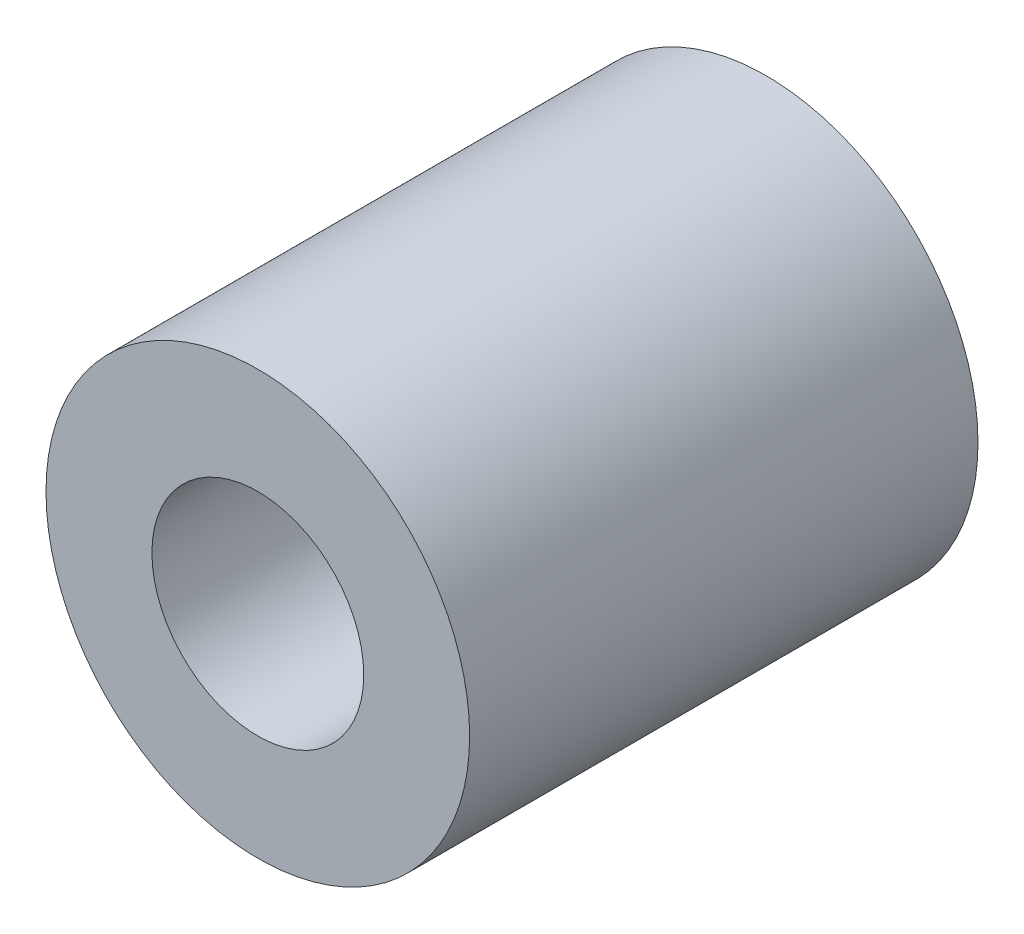
ISO-10303-21;
HEADER;
FILE_DESCRIPTION(('STEP AP214'),'2;1');
FILE_NAME('part.step','',(''),(''),'','','');
FILE_SCHEMA(('AUTOMOTIVE_DESIGN { 1 0 10303 214 1 1 1 1 }'));
ENDSEC;
DATA;
#1=APPLICATION_CONTEXT('core data for automotive mechanical design processes');
#2=APPLICATION_PROTOCOL_DEFINITION('international standard','automotive_design',2000,#1);
#3=PRODUCT_CONTEXT('',#1,'mechanical');
#4=PRODUCT('Part','Part','',(#3));
#5=PRODUCT_RELATED_PRODUCT_CATEGORY('part','',(#4));
#6=PRODUCT_DEFINITION_FORMATION('','',#4);
#7=PRODUCT_DEFINITION_CONTEXT('part definition',#1,'design');
#8=PRODUCT_DEFINITION('design','',#6,#7);
#9=PRODUCT_DEFINITION_SHAPE('','',#8);
#10=(LENGTH_UNIT() NAMED_UNIT(*) SI_UNIT(.MILLI.,.METRE.));
#11=(NAMED_UNIT(*) PLANE_ANGLE_UNIT() SI_UNIT($,.RADIAN.));
#12=(NAMED_UNIT(*) SI_UNIT($,.STERADIAN.) SOLID_ANGLE_UNIT());
#13=UNCERTAINTY_MEASURE_WITH_UNIT(LENGTH_MEASURE(1.E-05),#10,'distance_accuracy_value','');
#14=(GEOMETRIC_REPRESENTATION_CONTEXT(3) GLOBAL_UNCERTAINTY_ASSIGNED_CONTEXT((#13)) GLOBAL_UNIT_ASSIGNED_CONTEXT((#10,
#11,#12)) REPRESENTATION_CONTEXT('',''));
#15=CARTESIAN_POINT('',(0.,0.,0.));
#16=DIRECTION('',(0.,0.,1.));
#17=DIRECTION('',(1.,0.,0.));
#18=AXIS2_PLACEMENT_3D('',#15,#16,#17);
#19=CARTESIAN_POINT('',(0.,0.,12.));
#20=DIRECTION('',(0.,0.,1.));
#21=DIRECTION('',(1.,0.,0.));
#22=AXIS2_PLACEMENT_3D('',#19,#20,#21);
#23=PLANE('',#22);
#24=CARTESIAN_POINT('',(0.,0.,12.));
#25=DIRECTION('',(0.,0.,1.));
#26=DIRECTION('',(1.,0.,0.));
#27=AXIS2_PLACEMENT_3D('',#24,#25,#26);
#28=CIRCLE('',#27,5.);
#29=CARTESIAN_POINT('',(5.,0.,12.));
#30=VERTEX_POINT('',#29);
#31=EDGE_CURVE('E10',#30,#30,#28,.T.);
#32=ORIENTED_EDGE('',*,*,#31,.T.);
#33=EDGE_LOOP('',(#32));
#34=FACE_BOUND('',#33,.T.);
#35=CARTESIAN_POINT('',(0.,0.,12.));
#36=DIRECTION('',(0.,0.,1.));
#37=DIRECTION('',(1.,0.,0.));
#38=AXIS2_PLACEMENT_3D('',#35,#36,#37);
#39=CIRCLE('',#38,2.5);
#40=CARTESIAN_POINT('',(2.5,0.,12.));
#41=VERTEX_POINT('',#40);
#42=EDGE_CURVE('E42',#41,#41,#39,.T.);
#43=ORIENTED_EDGE('',*,*,#42,.F.);
#44=EDGE_LOOP('',(#43));
#45=FACE_BOUND('',#44,.T.);
#46=ADVANCED_FACE('F31',(#34,#45),#23,.T.);
#47=CARTESIAN_POINT('',(0.,0.,0.));
#48=DIRECTION('',(0.,0.,1.));
#49=DIRECTION('',(1.,0.,0.));
#50=AXIS2_PLACEMENT_3D('',#47,#48,#49);
#51=PLANE('',#50);
#52=CARTESIAN_POINT('',(0.,0.,0.));
#53=DIRECTION('',(0.,0.,1.));
#54=DIRECTION('',(1.,0.,0.));
#55=AXIS2_PLACEMENT_3D('',#52,#53,#54);
#56=CIRCLE('',#55,5.);
#57=CARTESIAN_POINT('',(5.,0.,0.));
#58=VERTEX_POINT('',#57);
#59=EDGE_CURVE('E35',#58,#58,#56,.T.);
#60=ORIENTED_EDGE('',*,*,#59,.F.);
#61=EDGE_LOOP('',(#60));
#62=FACE_BOUND('',#61,.T.);
#63=CARTESIAN_POINT('',(0.,0.,0.));
#64=DIRECTION('',(0.,0.,1.));
#65=DIRECTION('',(1.,0.,0.));
#66=AXIS2_PLACEMENT_3D('',#63,#64,#65);
#67=CIRCLE('',#66,2.5);
#68=CARTESIAN_POINT('',(2.5,0.,0.));
#69=VERTEX_POINT('',#68);
#70=EDGE_CURVE('E44',#69,#69,#67,.T.);
#71=ORIENTED_EDGE('',*,*,#70,.T.);
#72=EDGE_LOOP('',(#71));
#73=FACE_BOUND('',#72,.T.);
#74=ADVANCED_FACE('F54',(#62,#73),#51,.F.);
#75=CARTESIAN_POINT('',(0.,0.,12.));
#76=DIRECTION('',(0.,0.,-1.));
#77=DIRECTION('',(-1.,0.,0.));
#78=AXIS2_PLACEMENT_3D('',#75,#76,#77);
#79=CYLINDRICAL_SURFACE('',#78,5.);
#80=ORIENTED_EDGE('',*,*,#31,.F.);
#81=EDGE_LOOP('',(#80));
#82=FACE_BOUND('',#81,.T.);
#83=ORIENTED_EDGE('',*,*,#59,.T.);
#84=EDGE_LOOP('',(#83));
#85=FACE_BOUND('',#84,.T.);
#86=ADVANCED_FACE('F33',(#82,#85),#79,.T.);
#87=CARTESIAN_POINT('',(0.,0.,12.));
#88=DIRECTION('',(0.,0.,-1.));
#89=DIRECTION('',(-1.,0.,0.));
#90=AXIS2_PLACEMENT_3D('',#87,#88,#89);
#91=CYLINDRICAL_SURFACE('',#90,2.5);
#92=ORIENTED_EDGE('',*,*,#42,.T.);
#93=EDGE_LOOP('',(#92));
#94=FACE_BOUND('',#93,.T.);
#95=ORIENTED_EDGE('',*,*,#70,.F.);
#96=EDGE_LOOP('',(#95));
#97=FACE_BOUND('',#96,.T.);
#98=ADVANCED_FACE('F50',(#94,#97),#91,.F.);
#99=CLOSED_SHELL('',(#46,#74,#86,#98));
#100=MANIFOLD_SOLID_BREP('B2',#99);
#101=ADVANCED_BREP_SHAPE_REPRESENTATION('',(#18,#100),#14);
#102=SHAPE_DEFINITION_REPRESENTATION(#9,#101);
ENDSEC;
END-ISO-10303-21;
